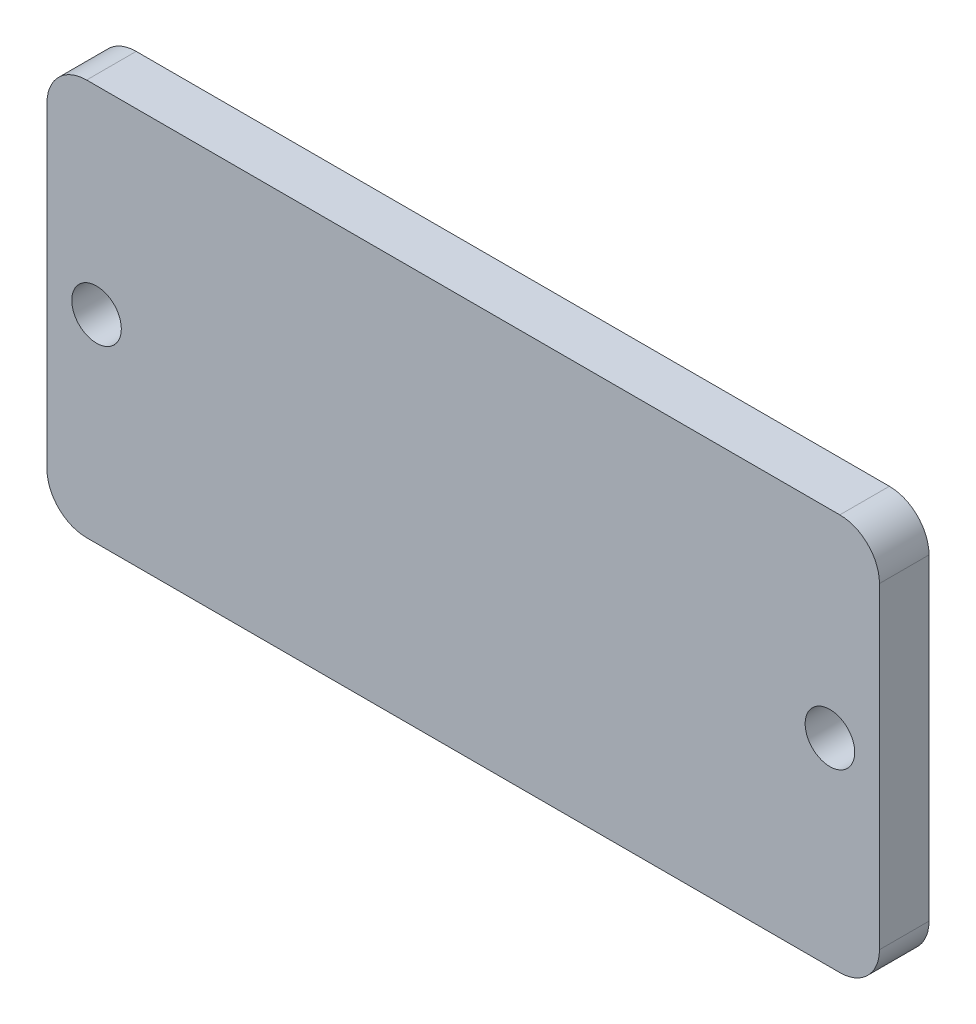
ISO-10303-21;
HEADER;
FILE_DESCRIPTION(('STEP AP214'),'2;1');
FILE_NAME('part.step','',(''),(''),'','','');
FILE_SCHEMA(('AUTOMOTIVE_DESIGN { 1 0 10303 214 1 1 1 1 }'));
ENDSEC;
DATA;
#1=APPLICATION_CONTEXT('core data for automotive mechanical design processes');
#2=APPLICATION_PROTOCOL_DEFINITION('international standard','automotive_design',2000,#1);
#3=PRODUCT_CONTEXT('',#1,'mechanical');
#4=PRODUCT('Part','Part','',(#3));
#5=PRODUCT_RELATED_PRODUCT_CATEGORY('part','',(#4));
#6=PRODUCT_DEFINITION_FORMATION('','',#4);
#7=PRODUCT_DEFINITION_CONTEXT('part definition',#1,'design');
#8=PRODUCT_DEFINITION('design','',#6,#7);
#9=PRODUCT_DEFINITION_SHAPE('','',#8);
#10=(LENGTH_UNIT() NAMED_UNIT(*) SI_UNIT(.MILLI.,.METRE.));
#11=(NAMED_UNIT(*) PLANE_ANGLE_UNIT() SI_UNIT($,.RADIAN.));
#12=(NAMED_UNIT(*) SI_UNIT($,.STERADIAN.) SOLID_ANGLE_UNIT());
#13=UNCERTAINTY_MEASURE_WITH_UNIT(LENGTH_MEASURE(1.E-05),#10,'distance_accuracy_value','');
#14=(GEOMETRIC_REPRESENTATION_CONTEXT(3) GLOBAL_UNCERTAINTY_ASSIGNED_CONTEXT((#13)) GLOBAL_UNIT_ASSIGNED_CONTEXT((#10,
#11,#12)) REPRESENTATION_CONTEXT('',''));
#15=CARTESIAN_POINT('',(0.,0.,0.));
#16=DIRECTION('',(0.,0.,1.));
#17=DIRECTION('',(1.,0.,0.));
#18=AXIS2_PLACEMENT_3D('',#15,#16,#17);
#19=CARTESIAN_POINT('',(24.13,-10.16,3.175));
#20=DIRECTION('',(0.,0.,1.));
#21=DIRECTION('',(1.,0.,0.));
#22=AXIS2_PLACEMENT_3D('',#19,#20,#21);
#23=PLANE('',#22);
#24=CARTESIAN_POINT('',(-23.495,0.,3.175));
#25=DIRECTION('',(0.,0.,1.));
#26=DIRECTION('',(1.,0.,0.));
#27=AXIS2_PLACEMENT_3D('',#24,#25,#26);
#28=CIRCLE('',#27,1.5875);
#29=CARTESIAN_POINT('',(-21.9075,0.,3.175));
#30=VERTEX_POINT('',#29);
#31=EDGE_CURVE('E131',#30,#30,#28,.T.);
#32=ORIENTED_EDGE('',*,*,#31,.F.);
#33=EDGE_LOOP('',(#32));
#34=FACE_BOUND('',#33,.T.);
#35=CARTESIAN_POINT('',(24.13,-10.16,3.175));
#36=DIRECTION('',(0.,0.,1.));
#37=DIRECTION('',(1.,0.,0.));
#38=AXIS2_PLACEMENT_3D('',#35,#36,#37);
#39=CIRCLE('',#38,2.54);
#40=CARTESIAN_POINT('',(24.13,-12.7,3.175));
#41=VERTEX_POINT('',#40);
#42=CARTESIAN_POINT('',(26.67,-10.16,3.175));
#43=VERTEX_POINT('',#42);
#44=EDGE_CURVE('E142',#41,#43,#39,.T.);
#45=ORIENTED_EDGE('',*,*,#44,.T.);
#46=DIRECTION('',(0.,1.,0.));
#47=VECTOR('',#46,1.);
#48=CARTESIAN_POINT('',(26.67,-10.16,3.175));
#49=LINE('',#48,#47);
#50=CARTESIAN_POINT('',(26.67,10.16,3.175));
#51=VERTEX_POINT('',#50);
#52=EDGE_CURVE('E90',#43,#51,#49,.T.);
#53=ORIENTED_EDGE('',*,*,#52,.T.);
#54=CARTESIAN_POINT('',(24.13,10.16,3.175));
#55=DIRECTION('',(0.,0.,1.));
#56=DIRECTION('',(1.,0.,0.));
#57=AXIS2_PLACEMENT_3D('',#54,#55,#56);
#58=CIRCLE('',#57,2.54);
#59=CARTESIAN_POINT('',(24.13,12.7,3.175));
#60=VERTEX_POINT('',#59);
#61=EDGE_CURVE('E157',#51,#60,#58,.T.);
#62=ORIENTED_EDGE('',*,*,#61,.T.);
#63=DIRECTION('',(-1.,0.,0.));
#64=VECTOR('',#63,1.);
#65=CARTESIAN_POINT('',(24.13,12.7,3.175));
#66=LINE('',#65,#64);
#67=CARTESIAN_POINT('',(-24.13,12.7,3.175));
#68=VERTEX_POINT('',#67);
#69=EDGE_CURVE('E170',#60,#68,#66,.T.);
#70=ORIENTED_EDGE('',*,*,#69,.T.);
#71=CARTESIAN_POINT('',(-24.13,10.16,3.175));
#72=DIRECTION('',(0.,0.,1.));
#73=DIRECTION('',(1.,0.,0.));
#74=AXIS2_PLACEMENT_3D('',#71,#72,#73);
#75=CIRCLE('',#74,2.54);
#76=CARTESIAN_POINT('',(-26.67,10.16,3.175));
#77=VERTEX_POINT('',#76);
#78=EDGE_CURVE('E109',#68,#77,#75,.T.);
#79=ORIENTED_EDGE('',*,*,#78,.T.);
#80=DIRECTION('',(0.,-1.,0.));
#81=VECTOR('',#80,1.);
#82=CARTESIAN_POINT('',(-26.67,-10.16,3.175));
#83=LINE('',#82,#81);
#84=CARTESIAN_POINT('',(-26.67,-10.16,3.175));
#85=VERTEX_POINT('',#84);
#86=EDGE_CURVE('E103',#77,#85,#83,.T.);
#87=ORIENTED_EDGE('',*,*,#86,.T.);
#88=CARTESIAN_POINT('',(-24.13,-10.16,3.175));
#89=DIRECTION('',(0.,0.,1.));
#90=DIRECTION('',(-1.,0.,0.));
#91=AXIS2_PLACEMENT_3D('',#88,#89,#90);
#92=CIRCLE('',#91,2.54);
#93=CARTESIAN_POINT('',(-24.13,-12.7,3.175));
#94=VERTEX_POINT('',#93);
#95=EDGE_CURVE('E107',#85,#94,#92,.T.);
#96=ORIENTED_EDGE('',*,*,#95,.T.);
#97=DIRECTION('',(1.,0.,0.));
#98=VECTOR('',#97,1.);
#99=CARTESIAN_POINT('',(24.13,-12.7,3.175));
#100=LINE('',#99,#98);
#101=EDGE_CURVE('E47',#94,#41,#100,.T.);
#102=ORIENTED_EDGE('',*,*,#101,.T.);
#103=EDGE_LOOP('',(#45,#53,#62,#70,#79,#87,#96,#102));
#104=FACE_BOUND('',#103,.T.);
#105=CARTESIAN_POINT('',(23.495,0.,3.175));
#106=DIRECTION('',(0.,0.,1.));
#107=DIRECTION('',(-1.,0.,0.));
#108=AXIS2_PLACEMENT_3D('',#105,#106,#107);
#109=CIRCLE('',#108,1.5875);
#110=CARTESIAN_POINT('',(21.9075,0.,3.175));
#111=VERTEX_POINT('',#110);
#112=EDGE_CURVE('E179',#111,#111,#109,.T.);
#113=ORIENTED_EDGE('',*,*,#112,.F.);
#114=EDGE_LOOP('',(#113));
#115=FACE_BOUND('',#114,.T.);
#116=ADVANCED_FACE('F30',(#34,#104,#115),#23,.T.);
#117=CARTESIAN_POINT('',(24.13,-10.16,0.));
#118=DIRECTION('',(0.,0.,1.));
#119=DIRECTION('',(1.,0.,0.));
#120=AXIS2_PLACEMENT_3D('',#117,#118,#119);
#121=PLANE('',#120);
#122=CARTESIAN_POINT('',(-23.495,0.,0.));
#123=DIRECTION('',(0.,0.,1.));
#124=DIRECTION('',(1.,0.,0.));
#125=AXIS2_PLACEMENT_3D('',#122,#123,#124);
#126=CIRCLE('',#125,1.5875);
#127=CARTESIAN_POINT('',(-21.9075,0.,0.));
#128=VERTEX_POINT('',#127);
#129=EDGE_CURVE('E176',#128,#128,#126,.T.);
#130=ORIENTED_EDGE('',*,*,#129,.T.);
#131=EDGE_LOOP('',(#130));
#132=FACE_BOUND('',#131,.T.);
#133=CARTESIAN_POINT('',(24.13,-10.16,0.));
#134=DIRECTION('',(0.,0.,1.));
#135=DIRECTION('',(1.,0.,0.));
#136=AXIS2_PLACEMENT_3D('',#133,#134,#135);
#137=CIRCLE('',#136,2.54);
#138=CARTESIAN_POINT('',(24.13,-12.7,0.));
#139=VERTEX_POINT('',#138);
#140=CARTESIAN_POINT('',(26.67,-10.16,0.));
#141=VERTEX_POINT('',#140);
#142=EDGE_CURVE('E127',#139,#141,#137,.T.);
#143=ORIENTED_EDGE('',*,*,#142,.F.);
#144=DIRECTION('',(1.,0.,0.));
#145=VECTOR('',#144,1.);
#146=CARTESIAN_POINT('',(24.13,-12.7,0.));
#147=LINE('',#146,#145);
#148=CARTESIAN_POINT('',(-24.13,-12.7,0.));
#149=VERTEX_POINT('',#148);
#150=EDGE_CURVE('E82',#149,#139,#147,.T.);
#151=ORIENTED_EDGE('',*,*,#150,.F.);
#152=CARTESIAN_POINT('',(-24.13,-10.16,0.));
#153=DIRECTION('',(0.,0.,1.));
#154=DIRECTION('',(-1.,0.,0.));
#155=AXIS2_PLACEMENT_3D('',#152,#153,#154);
#156=CIRCLE('',#155,2.54);
#157=CARTESIAN_POINT('',(-26.67,-10.16,0.));
#158=VERTEX_POINT('',#157);
#159=EDGE_CURVE('E76',#158,#149,#156,.T.);
#160=ORIENTED_EDGE('',*,*,#159,.F.);
#161=DIRECTION('',(0.,-1.,0.));
#162=VECTOR('',#161,1.);
#163=CARTESIAN_POINT('',(-26.67,-10.16,0.));
#164=LINE('',#163,#162);
#165=CARTESIAN_POINT('',(-26.67,10.16,0.));
#166=VERTEX_POINT('',#165);
#167=EDGE_CURVE('E117',#166,#158,#164,.T.);
#168=ORIENTED_EDGE('',*,*,#167,.F.);
#169=CARTESIAN_POINT('',(-24.13,10.16,0.));
#170=DIRECTION('',(0.,0.,1.));
#171=DIRECTION('',(1.,0.,0.));
#172=AXIS2_PLACEMENT_3D('',#169,#170,#171);
#173=CIRCLE('',#172,2.54);
#174=CARTESIAN_POINT('',(-24.13,12.7,0.));
#175=VERTEX_POINT('',#174);
#176=EDGE_CURVE('E137',#175,#166,#173,.T.);
#177=ORIENTED_EDGE('',*,*,#176,.F.);
#178=DIRECTION('',(-1.,0.,0.));
#179=VECTOR('',#178,1.);
#180=CARTESIAN_POINT('',(24.13,12.7,0.));
#181=LINE('',#180,#179);
#182=CARTESIAN_POINT('',(24.13,12.7,0.));
#183=VERTEX_POINT('',#182);
#184=EDGE_CURVE('E135',#183,#175,#181,.T.);
#185=ORIENTED_EDGE('',*,*,#184,.F.);
#186=CARTESIAN_POINT('',(24.13,10.16,0.));
#187=DIRECTION('',(0.,0.,1.));
#188=DIRECTION('',(1.,0.,0.));
#189=AXIS2_PLACEMENT_3D('',#186,#187,#188);
#190=CIRCLE('',#189,2.54);
#191=CARTESIAN_POINT('',(26.67,10.16,0.));
#192=VERTEX_POINT('',#191);
#193=EDGE_CURVE('E133',#192,#183,#190,.T.);
#194=ORIENTED_EDGE('',*,*,#193,.F.);
#195=DIRECTION('',(0.,1.,0.));
#196=VECTOR('',#195,1.);
#197=CARTESIAN_POINT('',(26.67,-10.16,0.));
#198=LINE('',#197,#196);
#199=EDGE_CURVE('E130',#141,#192,#198,.T.);
#200=ORIENTED_EDGE('',*,*,#199,.F.);
#201=EDGE_LOOP('',(#143,#151,#160,#168,#177,#185,#194,#200));
#202=FACE_BOUND('',#201,.T.);
#203=CARTESIAN_POINT('',(23.495,0.,0.));
#204=DIRECTION('',(0.,0.,1.));
#205=DIRECTION('',(-1.,0.,0.));
#206=AXIS2_PLACEMENT_3D('',#203,#204,#205);
#207=CIRCLE('',#206,1.5875);
#208=CARTESIAN_POINT('',(21.9075,0.,0.));
#209=VERTEX_POINT('',#208);
#210=EDGE_CURVE('E182',#209,#209,#207,.T.);
#211=ORIENTED_EDGE('',*,*,#210,.T.);
#212=EDGE_LOOP('',(#211));
#213=FACE_BOUND('',#212,.T.);
#214=ADVANCED_FACE('F161',(#132,#202,#213),#121,.F.);
#215=CARTESIAN_POINT('',(24.13,-10.16,3.175));
#216=DIRECTION('',(0.,0.,-1.));
#217=DIRECTION('',(-1.,0.,0.));
#218=AXIS2_PLACEMENT_3D('',#215,#216,#217);
#219=CYLINDRICAL_SURFACE('',#218,2.54);
#220=ORIENTED_EDGE('',*,*,#142,.T.);
#221=DIRECTION('',(0.,0.,-1.));
#222=VECTOR('',#221,1.);
#223=CARTESIAN_POINT('',(26.67,-10.16,3.175));
#224=LINE('',#223,#222);
#225=EDGE_CURVE('E11',#43,#141,#224,.T.);
#226=ORIENTED_EDGE('',*,*,#225,.F.);
#227=ORIENTED_EDGE('',*,*,#44,.F.);
#228=DIRECTION('',(0.,0.,-1.));
#229=VECTOR('',#228,1.);
#230=CARTESIAN_POINT('',(24.13,-12.7,3.175));
#231=LINE('',#230,#229);
#232=EDGE_CURVE('E123',#41,#139,#231,.T.);
#233=ORIENTED_EDGE('',*,*,#232,.T.);
#234=EDGE_LOOP('',(#220,#226,#227,#233));
#235=FACE_BOUND('',#234,.T.);
#236=ADVANCED_FACE('F32',(#235),#219,.T.);
#237=CARTESIAN_POINT('',(26.67,-10.16,3.175));
#238=DIRECTION('',(-1.,0.,0.));
#239=DIRECTION('',(0.,0.,1.));
#240=AXIS2_PLACEMENT_3D('',#237,#238,#239);
#241=PLANE('',#240);
#242=ORIENTED_EDGE('',*,*,#199,.T.);
#243=DIRECTION('',(0.,0.,-1.));
#244=VECTOR('',#243,1.);
#245=CARTESIAN_POINT('',(26.67,10.16,3.175));
#246=LINE('',#245,#244);
#247=EDGE_CURVE('E39',#51,#192,#246,.T.);
#248=ORIENTED_EDGE('',*,*,#247,.F.);
#249=ORIENTED_EDGE('',*,*,#52,.F.);
#250=ORIENTED_EDGE('',*,*,#225,.T.);
#251=EDGE_LOOP('',(#242,#248,#249,#250));
#252=FACE_BOUND('',#251,.T.);
#253=ADVANCED_FACE('F215',(#252),#241,.F.);
#254=CARTESIAN_POINT('',(24.13,10.16,3.175));
#255=DIRECTION('',(0.,0.,-1.));
#256=DIRECTION('',(-1.,0.,0.));
#257=AXIS2_PLACEMENT_3D('',#254,#255,#256);
#258=CYLINDRICAL_SURFACE('',#257,2.54);
#259=ORIENTED_EDGE('',*,*,#193,.T.);
#260=DIRECTION('',(0.,0.,-1.));
#261=VECTOR('',#260,1.);
#262=CARTESIAN_POINT('',(24.13,12.7,3.175));
#263=LINE('',#262,#261);
#264=EDGE_CURVE('E149',#60,#183,#263,.T.);
#265=ORIENTED_EDGE('',*,*,#264,.F.);
#266=ORIENTED_EDGE('',*,*,#61,.F.);
#267=ORIENTED_EDGE('',*,*,#247,.T.);
#268=EDGE_LOOP('',(#259,#265,#266,#267));
#269=FACE_BOUND('',#268,.T.);
#270=ADVANCED_FACE('F155',(#269),#258,.T.);
#271=CARTESIAN_POINT('',(24.13,12.7,3.175));
#272=DIRECTION('',(0.,-1.,0.));
#273=DIRECTION('',(0.,0.,-1.));
#274=AXIS2_PLACEMENT_3D('',#271,#272,#273);
#275=PLANE('',#274);
#276=ORIENTED_EDGE('',*,*,#184,.T.);
#277=DIRECTION('',(0.,0.,-1.));
#278=VECTOR('',#277,1.);
#279=CARTESIAN_POINT('',(-24.13,12.7,3.175));
#280=LINE('',#279,#278);
#281=EDGE_CURVE('E146',#68,#175,#280,.T.);
#282=ORIENTED_EDGE('',*,*,#281,.F.);
#283=ORIENTED_EDGE('',*,*,#69,.F.);
#284=ORIENTED_EDGE('',*,*,#264,.T.);
#285=EDGE_LOOP('',(#276,#282,#283,#284));
#286=FACE_BOUND('',#285,.T.);
#287=ADVANCED_FACE('F166',(#286),#275,.F.);
#288=CARTESIAN_POINT('',(-24.13,10.16,3.175));
#289=DIRECTION('',(0.,0.,-1.));
#290=DIRECTION('',(-1.,0.,0.));
#291=AXIS2_PLACEMENT_3D('',#288,#289,#290);
#292=CYLINDRICAL_SURFACE('',#291,2.54);
#293=ORIENTED_EDGE('',*,*,#176,.T.);
#294=DIRECTION('',(0.,0.,-1.));
#295=VECTOR('',#294,1.);
#296=CARTESIAN_POINT('',(-26.67,10.16,3.175));
#297=LINE('',#296,#295);
#298=EDGE_CURVE('E118',#77,#166,#297,.T.);
#299=ORIENTED_EDGE('',*,*,#298,.F.);
#300=ORIENTED_EDGE('',*,*,#78,.F.);
#301=ORIENTED_EDGE('',*,*,#281,.T.);
#302=EDGE_LOOP('',(#293,#299,#300,#301));
#303=FACE_BOUND('',#302,.T.);
#304=ADVANCED_FACE('F169',(#303),#292,.T.);
#305=CARTESIAN_POINT('',(-26.67,-10.16,3.175));
#306=DIRECTION('',(1.,0.,0.));
#307=DIRECTION('',(0.,0.,-1.));
#308=AXIS2_PLACEMENT_3D('',#305,#306,#307);
#309=PLANE('',#308);
#310=ORIENTED_EDGE('',*,*,#167,.T.);
#311=DIRECTION('',(0.,0.,-1.));
#312=VECTOR('',#311,1.);
#313=CARTESIAN_POINT('',(-26.67,-10.16,3.175));
#314=LINE('',#313,#312);
#315=EDGE_CURVE('E114',#85,#158,#314,.T.);
#316=ORIENTED_EDGE('',*,*,#315,.F.);
#317=ORIENTED_EDGE('',*,*,#86,.F.);
#318=ORIENTED_EDGE('',*,*,#298,.T.);
#319=EDGE_LOOP('',(#310,#316,#317,#318));
#320=FACE_BOUND('',#319,.T.);
#321=ADVANCED_FACE('F115',(#320),#309,.F.);
#322=CARTESIAN_POINT('',(-24.13,-10.16,3.175));
#323=DIRECTION('',(0.,0.,-1.));
#324=DIRECTION('',(-1.,0.,0.));
#325=AXIS2_PLACEMENT_3D('',#322,#323,#324);
#326=CYLINDRICAL_SURFACE('',#325,2.54);
#327=ORIENTED_EDGE('',*,*,#159,.T.);
#328=DIRECTION('',(0.,0.,-1.));
#329=VECTOR('',#328,1.);
#330=CARTESIAN_POINT('',(-24.13,-12.7,3.175));
#331=LINE('',#330,#329);
#332=EDGE_CURVE('E119',#94,#149,#331,.T.);
#333=ORIENTED_EDGE('',*,*,#332,.F.);
#334=ORIENTED_EDGE('',*,*,#95,.F.);
#335=ORIENTED_EDGE('',*,*,#315,.T.);
#336=EDGE_LOOP('',(#327,#333,#334,#335));
#337=FACE_BOUND('',#336,.T.);
#338=ADVANCED_FACE('F121',(#337),#326,.T.);
#339=CARTESIAN_POINT('',(24.13,-12.7,3.175));
#340=DIRECTION('',(0.,1.,0.));
#341=DIRECTION('',(0.,0.,1.));
#342=AXIS2_PLACEMENT_3D('',#339,#340,#341);
#343=PLANE('',#342);
#344=ORIENTED_EDGE('',*,*,#150,.T.);
#345=ORIENTED_EDGE('',*,*,#232,.F.);
#346=ORIENTED_EDGE('',*,*,#101,.F.);
#347=ORIENTED_EDGE('',*,*,#332,.T.);
#348=EDGE_LOOP('',(#344,#345,#346,#347));
#349=FACE_BOUND('',#348,.T.);
#350=ADVANCED_FACE('F203',(#349),#343,.F.);
#351=CARTESIAN_POINT('',(-23.495,0.,3.175));
#352=DIRECTION('',(0.,0.,-1.));
#353=DIRECTION('',(-1.,0.,0.));
#354=AXIS2_PLACEMENT_3D('',#351,#352,#353);
#355=CYLINDRICAL_SURFACE('',#354,1.5875);
#356=ORIENTED_EDGE('',*,*,#31,.T.);
#357=EDGE_LOOP('',(#356));
#358=FACE_BOUND('',#357,.T.);
#359=ORIENTED_EDGE('',*,*,#129,.F.);
#360=EDGE_LOOP('',(#359));
#361=FACE_BOUND('',#360,.T.);
#362=ADVANCED_FACE('F200',(#358,#361),#355,.F.);
#363=CARTESIAN_POINT('',(23.495,0.,3.175));
#364=DIRECTION('',(0.,0.,-1.));
#365=DIRECTION('',(-1.,0.,0.));
#366=AXIS2_PLACEMENT_3D('',#363,#364,#365);
#367=CYLINDRICAL_SURFACE('',#366,1.5875);
#368=ORIENTED_EDGE('',*,*,#112,.T.);
#369=EDGE_LOOP('',(#368));
#370=FACE_BOUND('',#369,.T.);
#371=ORIENTED_EDGE('',*,*,#210,.F.);
#372=EDGE_LOOP('',(#371));
#373=FACE_BOUND('',#372,.T.);
#374=ADVANCED_FACE('F188',(#370,#373),#367,.F.);
#375=CLOSED_SHELL('',(#116,#214,#236,#253,#270,#287,#304,#321,#338,#350,#362,#374));
#376=MANIFOLD_SOLID_BREP('B2',#375);
#377=ADVANCED_BREP_SHAPE_REPRESENTATION('',(#18,#376),#14);
#378=SHAPE_DEFINITION_REPRESENTATION(#9,#377);
ENDSEC;
END-ISO-10303-21;
